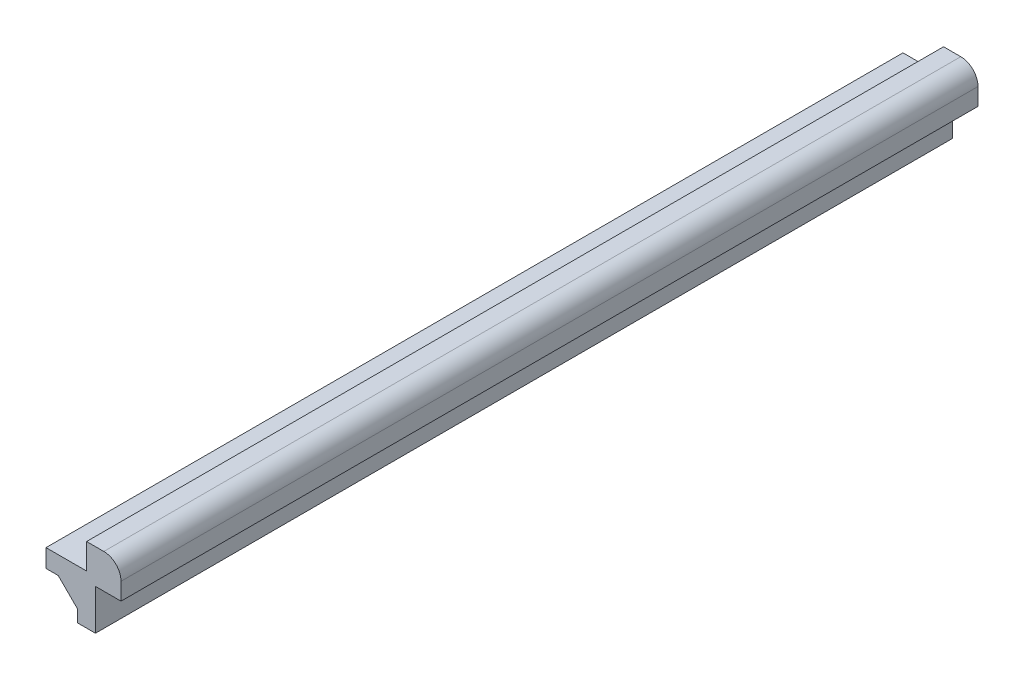
ISO-10303-21;
HEADER;
FILE_DESCRIPTION(('STEP AP214'),'2;1');
FILE_NAME('part.step','',(''),(''),'','','');
FILE_SCHEMA(('AUTOMOTIVE_DESIGN { 1 0 10303 214 1 1 1 1 }'));
ENDSEC;
DATA;
#1=APPLICATION_CONTEXT('core data for automotive mechanical design processes');
#2=APPLICATION_PROTOCOL_DEFINITION('international standard','automotive_design',2000,#1);
#3=PRODUCT_CONTEXT('',#1,'mechanical');
#4=PRODUCT('Part','Part','',(#3));
#5=PRODUCT_RELATED_PRODUCT_CATEGORY('part','',(#4));
#6=PRODUCT_DEFINITION_FORMATION('','',#4);
#7=PRODUCT_DEFINITION_CONTEXT('part definition',#1,'design');
#8=PRODUCT_DEFINITION('design','',#6,#7);
#9=PRODUCT_DEFINITION_SHAPE('','',#8);
#10=(LENGTH_UNIT() NAMED_UNIT(*) SI_UNIT(.MILLI.,.METRE.));
#11=(NAMED_UNIT(*) PLANE_ANGLE_UNIT() SI_UNIT($,.RADIAN.));
#12=(NAMED_UNIT(*) SI_UNIT($,.STERADIAN.) SOLID_ANGLE_UNIT());
#13=UNCERTAINTY_MEASURE_WITH_UNIT(LENGTH_MEASURE(1.E-05),#10,'distance_accuracy_value','');
#14=(GEOMETRIC_REPRESENTATION_CONTEXT(3) GLOBAL_UNCERTAINTY_ASSIGNED_CONTEXT((#13)) GLOBAL_UNIT_ASSIGNED_CONTEXT((#10,
#11,#12)) REPRESENTATION_CONTEXT('',''));
#15=CARTESIAN_POINT('',(0.,0.,0.));
#16=DIRECTION('',(0.,0.,1.));
#17=DIRECTION('',(1.,0.,0.));
#18=AXIS2_PLACEMENT_3D('',#15,#16,#17);
#19=CARTESIAN_POINT('',(-7.3025,-3.621225168,50.27295));
#20=DIRECTION('',(0.,1.,0.));
#21=DIRECTION('',(0.,0.,1.));
#22=AXIS2_PLACEMENT_3D('',#19,#20,#21);
#23=PLANE('',#22);
#24=DIRECTION('',(0.,0.,-1.));
#25=VECTOR('',#24,1.);
#26=CARTESIAN_POINT('',(-5.8662891982673,-3.621225168,50.27295));
#27=LINE('',#26,#25);
#28=CARTESIAN_POINT('',(-5.8662891982673,-3.621225168,50.27295));
#29=VERTEX_POINT('',#28);
#30=CARTESIAN_POINT('',(-5.8662891982673,-3.621225168,-50.27295));
#31=VERTEX_POINT('',#30);
#32=EDGE_CURVE('E48',#29,#31,#27,.T.);
#33=ORIENTED_EDGE('',*,*,#32,.F.);
#34=DIRECTION('',(1.,0.,0.));
#35=VECTOR('',#34,1.);
#36=CARTESIAN_POINT('',(-7.3025,-3.621225168,50.27295));
#37=LINE('',#36,#35);
#38=CARTESIAN_POINT('',(-7.3025,-3.621225168,50.27295));
#39=VERTEX_POINT('',#38);
#40=EDGE_CURVE('E173',#39,#29,#37,.T.);
#41=ORIENTED_EDGE('',*,*,#40,.F.);
#42=DIRECTION('',(0.,0.,-1.));
#43=VECTOR('',#42,1.);
#44=CARTESIAN_POINT('',(-7.3025,-3.621225168,50.27295));
#45=LINE('',#44,#43);
#46=CARTESIAN_POINT('',(-7.3025,-3.621225168,-50.27295));
#47=VERTEX_POINT('',#46);
#48=EDGE_CURVE('E11',#39,#47,#45,.T.);
#49=ORIENTED_EDGE('',*,*,#48,.T.);
#50=DIRECTION('',(1.,0.,0.));
#51=VECTOR('',#50,1.);
#52=CARTESIAN_POINT('',(-7.3025,-3.621225168,-50.27295));
#53=LINE('',#52,#51);
#54=EDGE_CURVE('E52',#47,#31,#53,.T.);
#55=ORIENTED_EDGE('',*,*,#54,.T.);
#56=EDGE_LOOP('',(#33,#41,#49,#55));
#57=FACE_BOUND('',#56,.T.);
#58=ADVANCED_FACE('F33',(#57),#23,.F.);
#59=CARTESIAN_POINT('',(-3.62122516800001,-2.53999999999999,50.27295));
#60=DIRECTION('',(1.,0.,0.));
#61=DIRECTION('',(0.,1.,0.));
#62=AXIS2_PLACEMENT_3D('',#59,#60,#61);
#63=PLANE('',#62);
#64=DIRECTION('',(0.,0.,-1.));
#65=VECTOR('',#64,1.);
#66=CARTESIAN_POINT('',(-3.62122516800001,-5.86628919826729,50.27295));
#67=LINE('',#66,#65);
#68=CARTESIAN_POINT('',(-3.62122516800002,-5.86628919826728,50.27295));
#69=VERTEX_POINT('',#68);
#70=CARTESIAN_POINT('',(-3.62122516800001,-5.86628919826729,-50.27295));
#71=VERTEX_POINT('',#70);
#72=EDGE_CURVE('E147',#69,#71,#67,.T.);
#73=ORIENTED_EDGE('',*,*,#72,.T.);
#74=DIRECTION('',(0.,-1.,0.));
#75=VECTOR('',#74,1.);
#76=CARTESIAN_POINT('',(-3.62122516800001,-2.53999999999999,-50.27295));
#77=LINE('',#76,#75);
#78=CARTESIAN_POINT('',(-3.62122516800002,-7.30249999999999,-50.27295));
#79=VERTEX_POINT('',#78);
#80=EDGE_CURVE('E143',#71,#79,#77,.T.);
#81=ORIENTED_EDGE('',*,*,#80,.T.);
#82=DIRECTION('',(0.,0.,-1.));
#83=VECTOR('',#82,1.);
#84=CARTESIAN_POINT('',(-3.62122516800002,-7.30249999999999,50.27295));
#85=LINE('',#84,#83);
#86=CARTESIAN_POINT('',(-3.62122516800002,-7.30249999999999,50.27295));
#87=VERTEX_POINT('',#86);
#88=EDGE_CURVE('E166',#87,#79,#85,.T.);
#89=ORIENTED_EDGE('',*,*,#88,.F.);
#90=DIRECTION('',(0.,-1.,0.));
#91=VECTOR('',#90,1.);
#92=CARTESIAN_POINT('',(-3.62122516800001,-2.53999999999999,50.27295));
#93=LINE('',#92,#91);
#94=EDGE_CURVE('E151',#69,#87,#93,.T.);
#95=ORIENTED_EDGE('',*,*,#94,.F.);
#96=EDGE_LOOP('',(#73,#81,#89,#95));
#97=FACE_BOUND('',#96,.T.);
#98=ADVANCED_FACE('F215',(#97),#63,.F.);
#99=CARTESIAN_POINT('',(-7.3025,-1.500000048,50.27295));
#100=DIRECTION('',(1.,0.,0.));
#101=DIRECTION('',(0.,0.,-1.));
#102=AXIS2_PLACEMENT_3D('',#99,#100,#101);
#103=PLANE('',#102);
#104=DIRECTION('',(0.,-1.,0.));
#105=VECTOR('',#104,1.);
#106=CARTESIAN_POINT('',(-7.3025,-1.500000048,-50.27295));
#107=LINE('',#106,#105);
#108=CARTESIAN_POINT('',(-7.3025,-1.500000048,-50.27295));
#109=VERTEX_POINT('',#108);
#110=EDGE_CURVE('E169',#109,#47,#107,.T.);
#111=ORIENTED_EDGE('',*,*,#110,.T.);
#112=ORIENTED_EDGE('',*,*,#48,.F.);
#113=DIRECTION('',(0.,-1.,0.));
#114=VECTOR('',#113,1.);
#115=CARTESIAN_POINT('',(-7.3025,-1.500000048,50.27295));
#116=LINE('',#115,#114);
#117=CARTESIAN_POINT('',(-7.3025,-1.500000048,50.27295));
#118=VERTEX_POINT('',#117);
#119=EDGE_CURVE('E170',#118,#39,#116,.T.);
#120=ORIENTED_EDGE('',*,*,#119,.F.);
#121=DIRECTION('',(0.,0.,-1.));
#122=VECTOR('',#121,1.);
#123=CARTESIAN_POINT('',(-7.3025,-1.500000048,50.27295));
#124=LINE('',#123,#122);
#125=EDGE_CURVE('E178',#118,#109,#124,.T.);
#126=ORIENTED_EDGE('',*,*,#125,.T.);
#127=EDGE_LOOP('',(#111,#112,#120,#126));
#128=FACE_BOUND('',#127,.T.);
#129=ADVANCED_FACE('F35',(#128),#103,.F.);
#130=CARTESIAN_POINT('',(-7.3025,-1.500000048,50.27295));
#131=DIRECTION('',(0.,-1.,0.));
#132=DIRECTION('',(1.,0.,0.));
#133=AXIS2_PLACEMENT_3D('',#130,#131,#132);
#134=PLANE('',#133);
#135=DIRECTION('',(-1.,0.,0.));
#136=VECTOR('',#135,1.);
#137=CARTESIAN_POINT('',(-7.3025,-1.500000048,-50.27295));
#138=LINE('',#137,#136);
#139=CARTESIAN_POINT('',(-2.54,-1.500000048,-50.27295));
#140=VERTEX_POINT('',#139);
#141=EDGE_CURVE('E174',#140,#109,#138,.T.);
#142=ORIENTED_EDGE('',*,*,#141,.T.);
#143=ORIENTED_EDGE('',*,*,#125,.F.);
#144=DIRECTION('',(-1.,0.,0.));
#145=VECTOR('',#144,1.);
#146=CARTESIAN_POINT('',(-7.3025,-1.500000048,50.27295));
#147=LINE('',#146,#145);
#148=CARTESIAN_POINT('',(-2.54,-1.500000048,50.27295));
#149=VERTEX_POINT('',#148);
#150=EDGE_CURVE('E176',#149,#118,#147,.T.);
#151=ORIENTED_EDGE('',*,*,#150,.F.);
#152=DIRECTION('',(0.,0.,-1.));
#153=VECTOR('',#152,1.);
#154=CARTESIAN_POINT('',(-2.54,-1.500000048,50.27295));
#155=LINE('',#154,#153);
#156=EDGE_CURVE('E41',#149,#140,#155,.T.);
#157=ORIENTED_EDGE('',*,*,#156,.T.);
#158=EDGE_LOOP('',(#142,#143,#151,#157));
#159=FACE_BOUND('',#158,.T.);
#160=ADVANCED_FACE('F186',(#159),#134,.F.);
#161=CARTESIAN_POINT('',(0.,0.,50.27295));
#162=DIRECTION('',(0.,0.,1.));
#163=DIRECTION('',(1.,0.,0.));
#164=AXIS2_PLACEMENT_3D('',#161,#162,#163);
#165=PLANE('',#164);
#166=ORIENTED_EDGE('',*,*,#40,.T.);
#167=DIRECTION('',(0.707106781186547,-0.707106781186548,0.));
#168=VECTOR('',#167,1.);
#169=CARTESIAN_POINT('',(-5.8662891982673,-3.621225168,50.27295));
#170=LINE('',#169,#168);
#171=EDGE_CURVE('E128',#29,#69,#170,.T.);
#172=ORIENTED_EDGE('',*,*,#171,.T.);
#173=ORIENTED_EDGE('',*,*,#94,.T.);
#174=DIRECTION('',(1.,0.,0.));
#175=VECTOR('',#174,1.);
#176=CARTESIAN_POINT('',(-1.50000004800003,-7.30249999999999,50.27295));
#177=LINE('',#176,#175);
#178=CARTESIAN_POINT('',(-1.50000004800003,-7.30249999999999,50.27295));
#179=VERTEX_POINT('',#178);
#180=EDGE_CURVE('E153',#87,#179,#177,.T.);
#181=ORIENTED_EDGE('',*,*,#180,.T.);
#182=DIRECTION('',(0.,1.,0.));
#183=VECTOR('',#182,1.);
#184=CARTESIAN_POINT('',(-1.50000004800001,-2.53999999999999,50.27295));
#185=LINE('',#184,#183);
#186=CARTESIAN_POINT('',(-1.50000004800001,-2.53999999999999,50.27295));
#187=VERTEX_POINT('',#186);
#188=EDGE_CURVE('E156',#179,#187,#185,.T.);
#189=ORIENTED_EDGE('',*,*,#188,.T.);
#190=DIRECTION('',(1.,0.,0.));
#191=VECTOR('',#190,1.);
#192=CARTESIAN_POINT('',(-1.50000004800001,-2.53999999999999,50.27295));
#193=LINE('',#192,#191);
#194=CARTESIAN_POINT('',(1.50000004799999,-2.54,50.27295));
#195=VERTEX_POINT('',#194);
#196=EDGE_CURVE('E233',#187,#195,#193,.T.);
#197=ORIENTED_EDGE('',*,*,#196,.T.);
#198=DIRECTION('',(0.,1.,0.));
#199=VECTOR('',#198,1.);
#200=CARTESIAN_POINT('',(1.50000004799999,-0.519999976000009,50.27295));
#201=LINE('',#200,#199);
#202=CARTESIAN_POINT('',(1.50000004799999,-0.519999976000009,50.27295));
#203=VERTEX_POINT('',#202);
#204=EDGE_CURVE('E236',#195,#203,#201,.T.);
#205=ORIENTED_EDGE('',*,*,#204,.T.);
#206=CARTESIAN_POINT('',(-0.519999976000009,-0.519999976000014,50.27295));
#207=DIRECTION('',(0.,0.,1.));
#208=DIRECTION('',(-1.,0.,0.));
#209=AXIS2_PLACEMENT_3D('',#206,#207,#208);
#210=CIRCLE('',#209,2.020000024);
#211=CARTESIAN_POINT('',(-0.519999976000004,1.50000004799999,50.27295));
#212=VERTEX_POINT('',#211);
#213=EDGE_CURVE('E134',#203,#212,#210,.T.);
#214=ORIENTED_EDGE('',*,*,#213,.T.);
#215=DIRECTION('',(-1.,0.,0.));
#216=VECTOR('',#215,1.);
#217=CARTESIAN_POINT('',(-2.54,1.500000048,50.27295));
#218=LINE('',#217,#216);
#219=CARTESIAN_POINT('',(-2.54,1.500000048,50.27295));
#220=VERTEX_POINT('',#219);
#221=EDGE_CURVE('E129',#212,#220,#218,.T.);
#222=ORIENTED_EDGE('',*,*,#221,.T.);
#223=DIRECTION('',(0.,-1.,0.));
#224=VECTOR('',#223,1.);
#225=CARTESIAN_POINT('',(-2.54,1.500000048,50.27295));
#226=LINE('',#225,#224);
#227=EDGE_CURVE('E120',#220,#149,#226,.T.);
#228=ORIENTED_EDGE('',*,*,#227,.T.);
#229=ORIENTED_EDGE('',*,*,#150,.T.);
#230=ORIENTED_EDGE('',*,*,#119,.T.);
#231=EDGE_LOOP('',(#166,#172,#173,#181,#189,#197,#205,#214,#222,#228,#229,#230));
#232=FACE_BOUND('',#231,.T.);
#233=ADVANCED_FACE('F132',(#232),#165,.T.);
#234=CARTESIAN_POINT('',(0.,0.,-50.27295));
#235=DIRECTION('',(0.,0.,1.));
#236=DIRECTION('',(1.,0.,0.));
#237=AXIS2_PLACEMENT_3D('',#234,#235,#236);
#238=PLANE('',#237);
#239=DIRECTION('',(0.707106781186547,-0.707106781186548,0.));
#240=VECTOR('',#239,1.);
#241=CARTESIAN_POINT('',(-5.8662891982673,-3.621225168,-50.27295));
#242=LINE('',#241,#240);
#243=EDGE_CURVE('E193',#31,#71,#242,.T.);
#244=ORIENTED_EDGE('',*,*,#243,.F.);
#245=ORIENTED_EDGE('',*,*,#54,.F.);
#246=ORIENTED_EDGE('',*,*,#110,.F.);
#247=ORIENTED_EDGE('',*,*,#141,.F.);
#248=DIRECTION('',(0.,-1.,0.));
#249=VECTOR('',#248,1.);
#250=CARTESIAN_POINT('',(-2.54,1.500000048,-50.27295));
#251=LINE('',#250,#249);
#252=CARTESIAN_POINT('',(-2.54,1.500000048,-50.27295));
#253=VERTEX_POINT('',#252);
#254=EDGE_CURVE('E192',#253,#140,#251,.T.);
#255=ORIENTED_EDGE('',*,*,#254,.F.);
#256=DIRECTION('',(-1.,0.,0.));
#257=VECTOR('',#256,1.);
#258=CARTESIAN_POINT('',(-2.54,1.500000048,-50.27295));
#259=LINE('',#258,#257);
#260=CARTESIAN_POINT('',(-0.519999976000004,1.50000004799999,-50.27295));
#261=VERTEX_POINT('',#260);
#262=EDGE_CURVE('E142',#261,#253,#259,.T.);
#263=ORIENTED_EDGE('',*,*,#262,.F.);
#264=CARTESIAN_POINT('',(-0.519999976000009,-0.519999976000014,-50.27295));
#265=DIRECTION('',(0.,0.,1.));
#266=DIRECTION('',(-1.,0.,0.));
#267=AXIS2_PLACEMENT_3D('',#264,#265,#266);
#268=CIRCLE('',#267,2.020000024);
#269=CARTESIAN_POINT('',(1.50000004799999,-0.519999976000009,-50.27295));
#270=VERTEX_POINT('',#269);
#271=EDGE_CURVE('E138',#270,#261,#268,.T.);
#272=ORIENTED_EDGE('',*,*,#271,.F.);
#273=DIRECTION('',(0.,1.,0.));
#274=VECTOR('',#273,1.);
#275=CARTESIAN_POINT('',(1.50000004799999,-0.519999976000009,-50.27295));
#276=LINE('',#275,#274);
#277=CARTESIAN_POINT('',(1.50000004799999,-2.54,-50.27295));
#278=VERTEX_POINT('',#277);
#279=EDGE_CURVE('E202',#278,#270,#276,.T.);
#280=ORIENTED_EDGE('',*,*,#279,.F.);
#281=DIRECTION('',(1.,0.,0.));
#282=VECTOR('',#281,1.);
#283=CARTESIAN_POINT('',(-1.50000004800001,-2.53999999999999,-50.27295));
#284=LINE('',#283,#282);
#285=CARTESIAN_POINT('',(-1.50000004800001,-2.53999999999999,-50.27295));
#286=VERTEX_POINT('',#285);
#287=EDGE_CURVE('E196',#286,#278,#284,.T.);
#288=ORIENTED_EDGE('',*,*,#287,.F.);
#289=DIRECTION('',(0.,1.,0.));
#290=VECTOR('',#289,1.);
#291=CARTESIAN_POINT('',(-1.50000004800001,-2.53999999999999,-50.27295));
#292=LINE('',#291,#290);
#293=CARTESIAN_POINT('',(-1.50000004800003,-7.30249999999999,-50.27295));
#294=VERTEX_POINT('',#293);
#295=EDGE_CURVE('E154',#294,#286,#292,.T.);
#296=ORIENTED_EDGE('',*,*,#295,.F.);
#297=DIRECTION('',(1.,0.,0.));
#298=VECTOR('',#297,1.);
#299=CARTESIAN_POINT('',(-1.50000004800003,-7.30249999999999,-50.27295));
#300=LINE('',#299,#298);
#301=EDGE_CURVE('E145',#79,#294,#300,.T.);
#302=ORIENTED_EDGE('',*,*,#301,.F.);
#303=ORIENTED_EDGE('',*,*,#80,.F.);
#304=EDGE_LOOP('',(#244,#245,#246,#247,#255,#263,#272,#280,#288,#296,#302,#303));
#305=FACE_BOUND('',#304,.T.);
#306=ADVANCED_FACE('F191',(#305),#238,.F.);
#307=CARTESIAN_POINT('',(-1.50000004800003,-7.30249999999999,50.27295));
#308=DIRECTION('',(0.,1.,0.));
#309=DIRECTION('',(-1.,0.,0.));
#310=AXIS2_PLACEMENT_3D('',#307,#308,#309);
#311=PLANE('',#310);
#312=ORIENTED_EDGE('',*,*,#301,.T.);
#313=DIRECTION('',(0.,0.,-1.));
#314=VECTOR('',#313,1.);
#315=CARTESIAN_POINT('',(-1.50000004800003,-7.30249999999999,50.27295));
#316=LINE('',#315,#314);
#317=EDGE_CURVE('E163',#179,#294,#316,.T.);
#318=ORIENTED_EDGE('',*,*,#317,.F.);
#319=ORIENTED_EDGE('',*,*,#180,.F.);
#320=ORIENTED_EDGE('',*,*,#88,.T.);
#321=EDGE_LOOP('',(#312,#318,#319,#320));
#322=FACE_BOUND('',#321,.T.);
#323=ADVANCED_FACE('F226',(#322),#311,.F.);
#324=CARTESIAN_POINT('',(-1.50000004800001,-2.53999999999999,50.27295));
#325=DIRECTION('',(-1.,0.,0.));
#326=DIRECTION('',(0.,-1.,0.));
#327=AXIS2_PLACEMENT_3D('',#324,#325,#326);
#328=PLANE('',#327);
#329=ORIENTED_EDGE('',*,*,#295,.T.);
#330=DIRECTION('',(0.,0.,-1.));
#331=VECTOR('',#330,1.);
#332=CARTESIAN_POINT('',(-1.50000004800001,-2.53999999999999,50.27295));
#333=LINE('',#332,#331);
#334=EDGE_CURVE('E157',#187,#286,#333,.T.);
#335=ORIENTED_EDGE('',*,*,#334,.F.);
#336=ORIENTED_EDGE('',*,*,#188,.F.);
#337=ORIENTED_EDGE('',*,*,#317,.T.);
#338=EDGE_LOOP('',(#329,#335,#336,#337));
#339=FACE_BOUND('',#338,.T.);
#340=ADVANCED_FACE('F230',(#339),#328,.F.);
#341=CARTESIAN_POINT('',(-0.519999976000009,-0.519999976000014,50.27295));
#342=DIRECTION('',(0.,0.,-1.));
#343=DIRECTION('',(-1.,0.,0.));
#344=AXIS2_PLACEMENT_3D('',#341,#342,#343);
#345=CYLINDRICAL_SURFACE('',#344,2.020000024);
#346=ORIENTED_EDGE('',*,*,#271,.T.);
#347=DIRECTION('',(0.,0.,-1.));
#348=VECTOR('',#347,1.);
#349=CARTESIAN_POINT('',(-0.519999976000004,1.50000004799999,50.27295));
#350=LINE('',#349,#348);
#351=EDGE_CURVE('E205',#212,#261,#350,.T.);
#352=ORIENTED_EDGE('',*,*,#351,.F.);
#353=ORIENTED_EDGE('',*,*,#213,.F.);
#354=DIRECTION('',(0.,0.,-1.));
#355=VECTOR('',#354,1.);
#356=CARTESIAN_POINT('',(1.50000004799999,-0.519999976000009,50.27295));
#357=LINE('',#356,#355);
#358=EDGE_CURVE('E207',#203,#270,#357,.T.);
#359=ORIENTED_EDGE('',*,*,#358,.T.);
#360=EDGE_LOOP('',(#346,#352,#353,#359));
#361=FACE_BOUND('',#360,.T.);
#362=ADVANCED_FACE('F246',(#361),#345,.T.);
#363=CARTESIAN_POINT('',(1.50000004799999,-0.519999976000009,50.27295));
#364=DIRECTION('',(-1.,0.,0.));
#365=DIRECTION('',(0.,0.,1.));
#366=AXIS2_PLACEMENT_3D('',#363,#364,#365);
#367=PLANE('',#366);
#368=ORIENTED_EDGE('',*,*,#279,.T.);
#369=ORIENTED_EDGE('',*,*,#358,.F.);
#370=ORIENTED_EDGE('',*,*,#204,.F.);
#371=DIRECTION('',(0.,0.,-1.));
#372=VECTOR('',#371,1.);
#373=CARTESIAN_POINT('',(1.50000004799999,-2.54,50.27295));
#374=LINE('',#373,#372);
#375=EDGE_CURVE('E210',#195,#278,#374,.T.);
#376=ORIENTED_EDGE('',*,*,#375,.T.);
#377=EDGE_LOOP('',(#368,#369,#370,#376));
#378=FACE_BOUND('',#377,.T.);
#379=ADVANCED_FACE('F242',(#378),#367,.F.);
#380=CARTESIAN_POINT('',(-1.50000004800001,-2.53999999999999,50.27295));
#381=DIRECTION('',(0.,1.,0.));
#382=DIRECTION('',(-1.,0.,0.));
#383=AXIS2_PLACEMENT_3D('',#380,#381,#382);
#384=PLANE('',#383);
#385=ORIENTED_EDGE('',*,*,#287,.T.);
#386=ORIENTED_EDGE('',*,*,#375,.F.);
#387=ORIENTED_EDGE('',*,*,#196,.F.);
#388=ORIENTED_EDGE('',*,*,#334,.T.);
#389=EDGE_LOOP('',(#385,#386,#387,#388));
#390=FACE_BOUND('',#389,.T.);
#391=ADVANCED_FACE('F248',(#390),#384,.F.);
#392=CARTESIAN_POINT('',(-2.54,1.500000048,50.27295));
#393=DIRECTION('',(1.,0.,0.));
#394=DIRECTION('',(0.,0.,-1.));
#395=AXIS2_PLACEMENT_3D('',#392,#393,#394);
#396=PLANE('',#395);
#397=ORIENTED_EDGE('',*,*,#254,.T.);
#398=ORIENTED_EDGE('',*,*,#156,.F.);
#399=ORIENTED_EDGE('',*,*,#227,.F.);
#400=DIRECTION('',(0.,0.,-1.));
#401=VECTOR('',#400,1.);
#402=CARTESIAN_POINT('',(-2.54,1.500000048,50.27295));
#403=LINE('',#402,#401);
#404=EDGE_CURVE('E125',#220,#253,#403,.T.);
#405=ORIENTED_EDGE('',*,*,#404,.T.);
#406=EDGE_LOOP('',(#397,#398,#399,#405));
#407=FACE_BOUND('',#406,.T.);
#408=ADVANCED_FACE('F123',(#407),#396,.F.);
#409=CARTESIAN_POINT('',(-2.54,1.500000048,50.27295));
#410=DIRECTION('',(0.,-1.,0.));
#411=DIRECTION('',(1.,0.,0.));
#412=AXIS2_PLACEMENT_3D('',#409,#410,#411);
#413=PLANE('',#412);
#414=ORIENTED_EDGE('',*,*,#262,.T.);
#415=ORIENTED_EDGE('',*,*,#404,.F.);
#416=ORIENTED_EDGE('',*,*,#221,.F.);
#417=ORIENTED_EDGE('',*,*,#351,.T.);
#418=EDGE_LOOP('',(#414,#415,#416,#417));
#419=FACE_BOUND('',#418,.T.);
#420=ADVANCED_FACE('F140',(#419),#413,.F.);
#421=CARTESIAN_POINT('',(-5.8662891982673,-3.621225168,50.27295));
#422=DIRECTION('',(0.707106781186548,0.707106781186547,0.));
#423=DIRECTION('',(-0.707106781186547,0.707106781186548,0.));
#424=AXIS2_PLACEMENT_3D('',#421,#422,#423);
#425=PLANE('',#424);
#426=ORIENTED_EDGE('',*,*,#243,.T.);
#427=ORIENTED_EDGE('',*,*,#72,.F.);
#428=ORIENTED_EDGE('',*,*,#171,.F.);
#429=ORIENTED_EDGE('',*,*,#32,.T.);
#430=EDGE_LOOP('',(#426,#427,#428,#429));
#431=FACE_BOUND('',#430,.T.);
#432=ADVANCED_FACE('F220',(#431),#425,.F.);
#433=CLOSED_SHELL('',(#58,#98,#129,#160,#233,#306,#323,#340,#362,#379,#391,#408,#420,#432));
#434=MANIFOLD_SOLID_BREP('B2',#433);
#435=ADVANCED_BREP_SHAPE_REPRESENTATION('',(#18,#434),#14);
#436=SHAPE_DEFINITION_REPRESENTATION(#9,#435);
ENDSEC;
END-ISO-10303-21;
